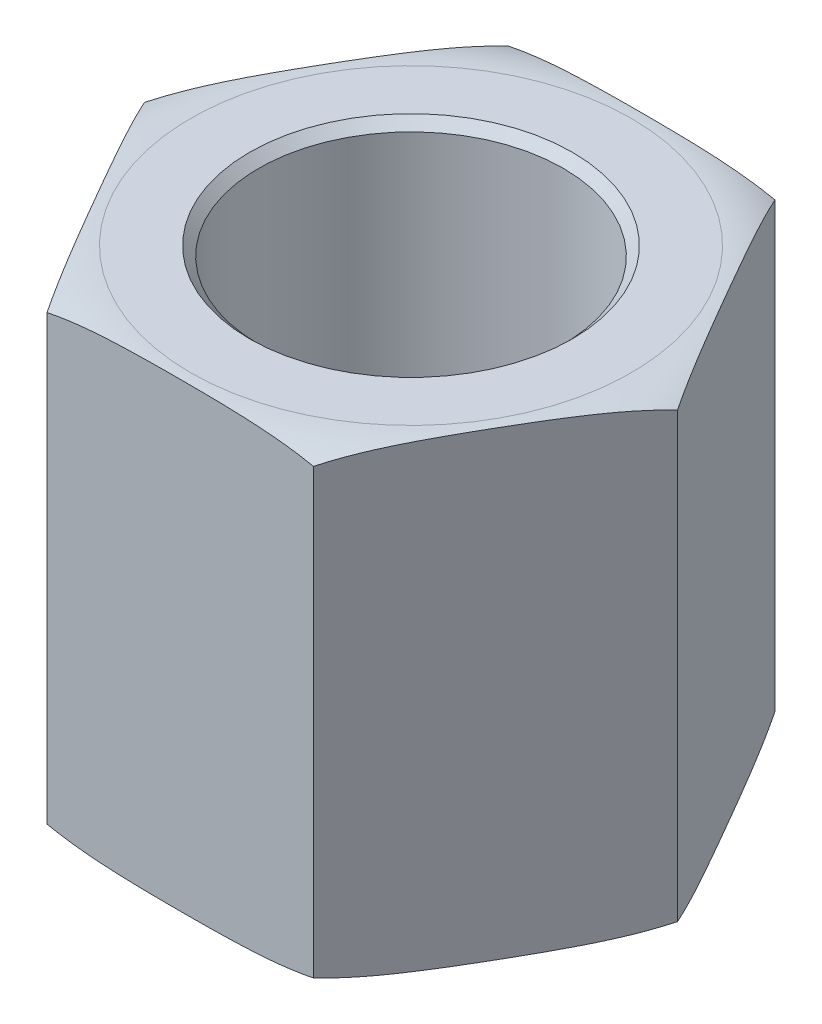
ISO-10303-21;
HEADER;
FILE_DESCRIPTION(('STEP AP214'),'2;1');
FILE_NAME('part.step','',(''),(''),'','','');
FILE_SCHEMA(('AUTOMOTIVE_DESIGN { 1 0 10303 214 1 1 1 1 }'));
ENDSEC;
DATA;
#1=APPLICATION_CONTEXT('core data for automotive mechanical design processes');
#2=APPLICATION_PROTOCOL_DEFINITION('international standard','automotive_design',2000,#1);
#3=PRODUCT_CONTEXT('',#1,'mechanical');
#4=PRODUCT('Part','Part','',(#3));
#5=PRODUCT_RELATED_PRODUCT_CATEGORY('part','',(#4));
#6=PRODUCT_DEFINITION_FORMATION('','',#4);
#7=PRODUCT_DEFINITION_CONTEXT('part definition',#1,'design');
#8=PRODUCT_DEFINITION('design','',#6,#7);
#9=PRODUCT_DEFINITION_SHAPE('','',#8);
#10=(LENGTH_UNIT() NAMED_UNIT(*) SI_UNIT(.MILLI.,.METRE.));
#11=(NAMED_UNIT(*) PLANE_ANGLE_UNIT() SI_UNIT($,.RADIAN.));
#12=(NAMED_UNIT(*) SI_UNIT($,.STERADIAN.) SOLID_ANGLE_UNIT());
#13=UNCERTAINTY_MEASURE_WITH_UNIT(LENGTH_MEASURE(1.E-05),#10,'distance_accuracy_value','');
#14=(GEOMETRIC_REPRESENTATION_CONTEXT(3) GLOBAL_UNCERTAINTY_ASSIGNED_CONTEXT((#13)) GLOBAL_UNIT_ASSIGNED_CONTEXT((#10,
#11,#12)) REPRESENTATION_CONTEXT('',''));
#15=CARTESIAN_POINT('',(0.,0.,0.));
#16=DIRECTION('',(0.,0.,1.));
#17=DIRECTION('',(1.,0.,0.));
#18=AXIS2_PLACEMENT_3D('',#15,#16,#17);
#19=CARTESIAN_POINT('',(3.66617420935412,3.175,0.));
#20=DIRECTION('',(-0.866025403784439,0.,0.5));
#21=DIRECTION('',(0.5,0.,0.866025403784439));
#22=AXIS2_PLACEMENT_3D('',#19,#20,#21);
#23=PLANE('',#22);
#24=DIRECTION('',(0.,1.,0.));
#25=VECTOR('',#24,1.);
#26=CARTESIAN_POINT('',(1.83308710467704,3.175,-3.175));
#27=LINE('',#26,#25);
#28=CARTESIAN_POINT('',(1.83308710467704,-3.048,-3.17500000000001));
#29=VERTEX_POINT('',#28);
#30=CARTESIAN_POINT('',(1.83308710467705,3.048,-3.175));
#31=VERTEX_POINT('',#30);
#32=EDGE_CURVE('E141',#29,#31,#27,.T.);
#33=ORIENTED_EDGE('',*,*,#32,.T.);
#34=CARTESIAN_POINT('',(3.66617420935412,3.048,0.));
#35=CARTESIAN_POINT('',(3.62797961467394,3.06390141489968,-0.0661549785605595));
#36=CARTESIAN_POINT('',(3.58956810864156,3.0774886076105,-0.132685658603879));
#37=CARTESIAN_POINT('',(3.5124905179571,3.10081619794021,-0.266187961794368));
#38=CARTESIAN_POINT('',(3.47382473049846,3.11056047713974,-0.333159070187402));
#39=CARTESIAN_POINT('',(3.39641631867872,3.1269966530451,-0.467234372392399));
#40=CARTESIAN_POINT('',(3.35767399633311,3.13369453286691,-0.534338043098205));
#41=CARTESIAN_POINT('',(3.28009834620112,3.1447767572932,-0.668703010557008));
#42=CARTESIAN_POINT('',(3.24126499587769,3.14916045047396,-0.735964346345298));
#43=CARTESIAN_POINT('',(3.16354065964313,3.15624030042628,-0.870586845688133));
#44=CARTESIAN_POINT('',(3.12464965374474,3.15893552375912,-0.937948043861607));
#45=CARTESIAN_POINT('',(3.0468514459459,3.16315319837134,-1.07269849250699));
#46=CARTESIAN_POINT('',(3.00794424351966,3.16467560802717,-1.1400877438896));
#47=CARTESIAN_POINT('',(2.9305151759887,3.16692270588903,-1.27419882283591));
#48=CARTESIAN_POINT('',(2.89199336248931,3.16765524681808,-1.34092056101655));
#49=CARTESIAN_POINT('',(2.8149477834614,3.16857673025741,-1.47436741839145));
#50=CARTESIAN_POINT('',(2.77642401791435,3.1687656658949,-1.54109253761781));
#51=CARTESIAN_POINT('',(2.69935964431008,3.16866599668056,-1.67457194815387));
#52=CARTESIAN_POINT('',(2.66081903631817,3.16837718117656,-1.74132623935046));
#53=CARTESIAN_POINT('',(2.58373908085325,3.167221986219,-1.87483263846085));
#54=CARTESIAN_POINT('',(2.5451997334124,3.16635559703857,-1.94158474631895));
#55=CARTESIAN_POINT('',(2.46812969629766,3.16378619406563,-2.07507396634291));
#56=CARTESIAN_POINT('',(2.4295990062596,3.16208322716165,-2.14181107913951));
#57=CARTESIAN_POINT('',(2.35255651340903,3.1574387229726,-2.27525259109846));
#58=CARTESIAN_POINT('',(2.31404470975437,3.1544972471358,-2.34195699171945));
#59=CARTESIAN_POINT('',(2.25084206239939,3.14821741247488,-2.45142718811113));
#60=CARTESIAN_POINT('',(2.22613849337005,3.14539801104631,-2.49421502479824));
#61=CARTESIAN_POINT('',(2.17676945272223,3.13886967943036,-2.57972471152119));
#62=CARTESIAN_POINT('',(2.15210397034179,3.1351610809139,-2.62244658019731));
#63=CARTESIAN_POINT('',(2.10282753811692,3.12668027114969,-2.7077958644265));
#64=CARTESIAN_POINT('',(2.07821657107525,3.12190846570084,-2.75042330976607));
#65=CARTESIAN_POINT('',(2.02900094683547,3.11109877125159,-2.8356672714756));
#66=CARTESIAN_POINT('',(2.00439646085461,3.10505773130842,-2.87828349128857));
#67=CARTESIAN_POINT('',(1.95527325900931,3.09151383541611,-2.96336737271508));
#68=CARTESIAN_POINT('',(1.93075459617612,3.08401019780296,-3.00583494247581));
#69=CARTESIAN_POINT('',(1.8818215737317,3.06732035070844,-3.09058942351746));
#70=CARTESIAN_POINT('',(1.85740744053269,3.05813149780328,-3.13287594264091));
#71=CARTESIAN_POINT('',(1.83308710467705,3.048,-3.175));
#72=B_SPLINE_CURVE_WITH_KNOTS('',3,(#34,#35,#36,#37,#38,#39,#40,#41,#42,#43,#44,#45,#46,#47,#48,
#49,#50,#51,#52,#53,#54,#55,#56,#57,#58,#59,#60,#61,#62,#63,#64,#65,#66,#67,#68,#69,#70,#71),
.UNSPECIFIED.,.F.,.F.,(4,2,2,2,2,2,2,2,2,2,2,2,2,2,2,2,2,2,4),(0.,0.23397730781795,
0.467717675040711,0.700996973557527,0.934341903229785,1.16781571967244,1.4012978217983,
1.63243665809676,1.86357841666624,2.09482211846302,2.32606971471504,2.55730435147407,
2.78852751694424,2.93698369265096,3.08538458004481,3.2337289233459,3.38244598546617,
3.53124274626086,3.68027493713586),.UNSPECIFIED.);
#73=CARTESIAN_POINT('',(3.66617420935412,3.048,0.));
#74=VERTEX_POINT('',#73);
#75=EDGE_CURVE('E95',#74,#31,#72,.T.);
#76=ORIENTED_EDGE('',*,*,#75,.F.);
#77=DIRECTION('',(0.,1.,0.));
#78=VECTOR('',#77,1.);
#79=CARTESIAN_POINT('',(3.66617420935412,3.175,0.));
#80=LINE('',#79,#78);
#81=CARTESIAN_POINT('',(3.66617420935412,-3.048,0.));
#82=VERTEX_POINT('',#81);
#83=EDGE_CURVE('E143',#74,#82,#80,.F.);
#84=ORIENTED_EDGE('',*,*,#83,.T.);
#85=CARTESIAN_POINT('',(1.83308710467705,-3.048,-3.17500000000001));
#86=CARTESIAN_POINT('',(1.87128169935723,-3.06390141489968,-3.10884502143945));
#87=CARTESIAN_POINT('',(1.9096932053896,-3.0774886076105,-3.04231434139613));
#88=CARTESIAN_POINT('',(1.98677079607407,-3.1008161979402,-2.90881203820564));
#89=CARTESIAN_POINT('',(2.02543658353271,-3.11056047713974,-2.84184092981261));
#90=CARTESIAN_POINT('',(2.10284499535245,-3.12699665304509,-2.70776562760762));
#91=CARTESIAN_POINT('',(2.14158731769805,-3.13369453286691,-2.64066195690181));
#92=CARTESIAN_POINT('',(2.21916296783005,-3.14477675729319,-2.50629698944301));
#93=CARTESIAN_POINT('',(2.25799631815347,-3.14916045047396,-2.43903565365472));
#94=CARTESIAN_POINT('',(2.33572065438803,-3.15624030042628,-2.30441315431189));
#95=CARTESIAN_POINT('',(2.37461166028642,-3.15893552375912,-2.23705195613842));
#96=CARTESIAN_POINT('',(2.45240986808526,-3.16315319837134,-2.10230150749304));
#97=CARTESIAN_POINT('',(2.49131707051149,-3.16467560802717,-2.03491225611043));
#98=CARTESIAN_POINT('',(2.56874613804246,-3.16692270588903,-1.90080117716412));
#99=CARTESIAN_POINT('',(2.60726795154184,-3.16765524681808,-1.83407943898349));
#100=CARTESIAN_POINT('',(2.68431353056976,-3.16857673025742,-1.70063258160858));
#101=CARTESIAN_POINT('',(2.7228372961168,-3.1687656658949,-1.63390746238223));
#102=CARTESIAN_POINT('',(2.79990166972107,-3.16866599668056,-1.50042805184616));
#103=CARTESIAN_POINT('',(2.83844227771298,-3.16837718117656,-1.43367376064958));
#104=CARTESIAN_POINT('',(2.9155222331779,-3.167221986219,-1.30016736153919));
#105=CARTESIAN_POINT('',(2.95406158061874,-3.16635559703857,-1.2334152536811));
#106=CARTESIAN_POINT('',(3.03113161773349,-3.16378619406563,-1.09992603365714));
#107=CARTESIAN_POINT('',(3.06966230777155,-3.16208322716165,-1.03318892086054));
#108=CARTESIAN_POINT('',(3.14670480062212,-3.15743872297261,-0.89974740890159));
#109=CARTESIAN_POINT('',(3.18521660427678,-3.1544972471358,-0.833043008280603));
#110=CARTESIAN_POINT('',(3.24841925163175,-3.14821741247488,-0.723572811888921));
#111=CARTESIAN_POINT('',(3.2731228206611,-3.14539801104632,-0.680784975201808));
#112=CARTESIAN_POINT('',(3.32249186130892,-3.13886967943036,-0.595275288478853));
#113=CARTESIAN_POINT('',(3.34715734368936,-3.1351610809139,-0.552553419802732));
#114=CARTESIAN_POINT('',(3.39643377591423,-3.12668027114969,-0.467204135573528));
#115=CARTESIAN_POINT('',(3.4210447429559,-3.12190846570084,-0.424576690233956));
#116=CARTESIAN_POINT('',(3.47026036719569,-3.11109877125159,-0.339332728524421));
#117=CARTESIAN_POINT('',(3.49486485317655,-3.10505773130842,-0.296716508711452));
#118=CARTESIAN_POINT('',(3.54398805502185,-3.09151383541612,-0.211632627284937));
#119=CARTESIAN_POINT('',(3.56850671785504,-3.08401019780296,-0.169165057524198));
#120=CARTESIAN_POINT('',(3.61743974029947,-3.06732035070844,-0.0844105764825437));
#121=CARTESIAN_POINT('',(3.64185387349848,-3.05813149780329,-0.0421240573590973));
#122=CARTESIAN_POINT('',(3.66617420935412,-3.048,0.));
#123=B_SPLINE_CURVE_WITH_KNOTS('',3,(#85,#86,#87,#88,#89,#90,#91,#92,#93,#94,#95,#96,#97,#98,
#99,#100,#101,#102,#103,#104,#105,#106,#107,#108,#109,#110,#111,#112,#113,#114,#115,#116,#117,
#118,#119,#120,#121,#122),.UNSPECIFIED.,.F.,.F.,(4,2,2,2,2,2,2,2,2,2,2,2,2,2,2,2,2,2,4),(0.,
0.233977307817946,0.467717675040702,0.700996973557513,0.934341903229767,1.16781571967242,
1.40129782179827,1.63243665809673,1.8635784166662,2.09482211846298,2.32606971471499,
2.55730435147402,2.78852751694418,2.93698369265092,3.08538458004477,3.23372892334588,
3.38244598546615,3.53124274626086,3.68027493713586),.UNSPECIFIED.);
#124=EDGE_CURVE('E219',#29,#82,#123,.T.);
#125=ORIENTED_EDGE('',*,*,#124,.F.);
#126=EDGE_LOOP('',(#33,#76,#84,#125));
#127=FACE_BOUND('',#126,.T.);
#128=ADVANCED_FACE('F15',(#127),#23,.F.);
#129=CARTESIAN_POINT('',(1.83308710467706,3.175,3.17499999999999));
#130=DIRECTION('',(-0.866025403784439,0.,-0.5));
#131=DIRECTION('',(-0.5,0.,0.866025403784439));
#132=AXIS2_PLACEMENT_3D('',#129,#130,#131);
#133=PLANE('',#132);
#134=ORIENTED_EDGE('',*,*,#83,.F.);
#135=CARTESIAN_POINT('',(1.83308710467706,3.048,3.17499999999999));
#136=CARTESIAN_POINT('',(1.87128169935724,3.06390141489968,3.10884502143943));
#137=CARTESIAN_POINT('',(1.90969320538962,3.0774886076105,3.04231434139611));
#138=CARTESIAN_POINT('',(1.98677079607408,3.10081619794021,2.90881203820562));
#139=CARTESIAN_POINT('',(2.02543658353273,3.11056047713974,2.84184092981259));
#140=CARTESIAN_POINT('',(2.10284499535246,3.1269966530451,2.70776562760759));
#141=CARTESIAN_POINT('',(2.14158731769807,3.13369453286691,2.64066195690179));
#142=CARTESIAN_POINT('',(2.21916296783006,3.1447767572932,2.50629698944298));
#143=CARTESIAN_POINT('',(2.25799631815349,3.14916045047396,2.43903565365469));
#144=CARTESIAN_POINT('',(2.33572065438805,3.15624030042628,2.30441315431186));
#145=CARTESIAN_POINT('',(2.37461166028644,3.15893552375912,2.23705195613839));
#146=CARTESIAN_POINT('',(2.45240986808528,3.16315319837134,2.102301507493));
#147=CARTESIAN_POINT('',(2.49131707051152,3.16467560802717,2.03491225611039));
#148=CARTESIAN_POINT('',(2.56874613804248,3.16692270588903,1.90080117716408));
#149=CARTESIAN_POINT('',(2.60726795154187,3.16765524681808,1.83407943898345));
#150=CARTESIAN_POINT('',(2.68431353056978,3.16857673025741,1.70063258160854));
#151=CARTESIAN_POINT('',(2.72283729611683,3.1687656658949,1.63390746238219));
#152=CARTESIAN_POINT('',(2.7999016697211,3.16866599668056,1.50042805184612));
#153=CARTESIAN_POINT('',(2.83844227771301,3.16837718117656,1.43367376064953));
#154=CARTESIAN_POINT('',(2.91552223317793,3.167221986219,1.30016736153914));
#155=CARTESIAN_POINT('',(2.95406158061878,3.16635559703857,1.23341525368105));
#156=CARTESIAN_POINT('',(3.03113161773353,3.16378619406563,1.09992603365708));
#157=CARTESIAN_POINT('',(3.06966230777158,3.16208322716165,1.03318892086048));
#158=CARTESIAN_POINT('',(3.14670480062215,3.1574387229726,0.899747408901533));
#159=CARTESIAN_POINT('',(3.18521660427681,3.1544972471358,0.833043008280545));
#160=CARTESIAN_POINT('',(3.24841925163179,3.14821741247488,0.723572811888865));
#161=CARTESIAN_POINT('',(3.27312282066113,3.14539801104631,0.680784975201756));
#162=CARTESIAN_POINT('',(3.32249186130895,3.13886967943036,0.595275288478808));
#163=CARTESIAN_POINT('',(3.34715734368939,3.1351610809139,0.55255341980269));
#164=CARTESIAN_POINT('',(3.39643377591426,3.12668027114969,0.467204135573494));
#165=CARTESIAN_POINT('',(3.42104474295592,3.12190846570084,0.424576690233925));
#166=CARTESIAN_POINT('',(3.47026036719571,3.11109877125159,0.339332728524397));
#167=CARTESIAN_POINT('',(3.49486485317657,3.10505773130842,0.296716508711432));
#168=CARTESIAN_POINT('',(3.54398805502186,3.09151383541612,0.211632627284924));
#169=CARTESIAN_POINT('',(3.56850671785505,3.08401019780296,0.169165057524189));
#170=CARTESIAN_POINT('',(3.61743974029947,3.06732035070844,0.0844105764825421));
#171=CARTESIAN_POINT('',(3.64185387349848,3.05813149780328,0.0421240573590994));
#172=CARTESIAN_POINT('',(3.66617420935412,3.048,0.));
#173=B_SPLINE_CURVE_WITH_KNOTS('',3,(#135,#136,#137,#138,#139,#140,#141,#142,#143,#144,#145,
#146,#147,#148,#149,#150,#151,#152,#153,#154,#155,#156,#157,#158,#159,#160,#161,#162,#163,#164,
#165,#166,#167,#168,#169,#170,#171,#172),.UNSPECIFIED.,.F.,.F.,(4,2,2,2,2,2,2,2,2,2,2,2,2,2,2,2,
2,2,4),(0.,0.23397730781795,0.467717675040712,0.700996973557526,0.934341903229785,
1.16781571967244,1.4012978217983,1.63243665809676,1.86357841666624,2.09482211846302,
2.32606971471504,2.55730435147407,2.78852751694424,2.93698369265096,3.0853845800448,
3.23372892334589,3.38244598546615,3.53124274626085,3.68027493713584),.UNSPECIFIED.);
#174=CARTESIAN_POINT('',(1.83308710467706,3.048,3.17499999999999));
#175=VERTEX_POINT('',#174);
#176=EDGE_CURVE('E212',#175,#74,#173,.T.);
#177=ORIENTED_EDGE('',*,*,#176,.F.);
#178=DIRECTION('',(0.,1.,0.));
#179=VECTOR('',#178,1.);
#180=CARTESIAN_POINT('',(1.83308710467706,3.175,3.17499999999999));
#181=LINE('',#180,#179);
#182=CARTESIAN_POINT('',(1.83308710467706,-3.048,3.17499999999999));
#183=VERTEX_POINT('',#182);
#184=EDGE_CURVE('E138',#175,#183,#181,.F.);
#185=ORIENTED_EDGE('',*,*,#184,.T.);
#186=CARTESIAN_POINT('',(3.66617420935412,-3.048,0.));
#187=CARTESIAN_POINT('',(3.62797961467394,-3.06390141489968,0.0661549785605642));
#188=CARTESIAN_POINT('',(3.58956810864156,-3.0774886076105,0.132685658603884));
#189=CARTESIAN_POINT('',(3.5124905179571,-3.10081619794021,0.266187961794373));
#190=CARTESIAN_POINT('',(3.47382473049845,-3.11056047713974,0.333159070187407));
#191=CARTESIAN_POINT('',(3.39641631867872,-3.1269966530451,0.467234372392404));
#192=CARTESIAN_POINT('',(3.35767399633311,-3.13369453286691,0.53433804309821));
#193=CARTESIAN_POINT('',(3.28009834620112,-3.1447767572932,0.668703010557013));
#194=CARTESIAN_POINT('',(3.24126499587769,-3.14916045047396,0.735964346345303));
#195=CARTESIAN_POINT('',(3.16354065964313,-3.15624030042628,0.870586845688138));
#196=CARTESIAN_POINT('',(3.12464965374474,-3.15893552375912,0.937948043861613));
#197=CARTESIAN_POINT('',(3.0468514459459,-3.16315319837134,1.07269849250699));
#198=CARTESIAN_POINT('',(3.00794424351966,-3.16467560802717,1.1400877438896));
#199=CARTESIAN_POINT('',(2.9305151759887,-3.16692270588903,1.27419882283592));
#200=CARTESIAN_POINT('',(2.89199336248931,-3.16765524681808,1.34092056101655));
#201=CARTESIAN_POINT('',(2.8149477834614,-3.16857673025741,1.47436741839146));
#202=CARTESIAN_POINT('',(2.77642401791435,-3.1687656658949,1.54109253761781));
#203=CARTESIAN_POINT('',(2.69935964431008,-3.16866599668056,1.67457194815388));
#204=CARTESIAN_POINT('',(2.66081903631817,-3.16837718117656,1.74132623935047));
#205=CARTESIAN_POINT('',(2.58373908085325,-3.167221986219,1.87483263846085));
#206=CARTESIAN_POINT('',(2.5451997334124,-3.16635559703857,1.94158474631895));
#207=CARTESIAN_POINT('',(2.46812969629765,-3.16378619406563,2.07507396634292));
#208=CARTESIAN_POINT('',(2.4295990062596,-3.16208322716165,2.14181107913952));
#209=CARTESIAN_POINT('',(2.35255651340903,-3.1574387229726,2.27525259109847));
#210=CARTESIAN_POINT('',(2.31404470975437,-3.1544972471358,2.34195699171945));
#211=CARTESIAN_POINT('',(2.25084206239939,-3.14821741247488,2.45142718811113));
#212=CARTESIAN_POINT('',(2.22613849337005,-3.14539801104631,2.49421502479824));
#213=CARTESIAN_POINT('',(2.17676945272223,-3.13886967943036,2.57972471152119));
#214=CARTESIAN_POINT('',(2.15210397034179,-3.1351610809139,2.62244658019731));
#215=CARTESIAN_POINT('',(2.10282753811692,-3.12668027114969,2.7077958644265));
#216=CARTESIAN_POINT('',(2.07821657107526,-3.12190846570084,2.75042330976607));
#217=CARTESIAN_POINT('',(2.02900094683547,-3.11109877125159,2.8356672714756));
#218=CARTESIAN_POINT('',(2.00439646085461,-3.10505773130842,2.87828349128856));
#219=CARTESIAN_POINT('',(1.95527325900932,-3.09151383541611,2.96336737271507));
#220=CARTESIAN_POINT('',(1.93075459617613,-3.08401019780296,3.00583494247581));
#221=CARTESIAN_POINT('',(1.88182157373171,-3.06732035070844,3.09058942351745));
#222=CARTESIAN_POINT('',(1.8574074405327,-3.05813149780328,3.1328759426409));
#223=CARTESIAN_POINT('',(1.83308710467706,-3.048,3.17499999999999));
#224=B_SPLINE_CURVE_WITH_KNOTS('',3,(#186,#187,#188,#189,#190,#191,#192,#193,#194,#195,#196,
#197,#198,#199,#200,#201,#202,#203,#204,#205,#206,#207,#208,#209,#210,#211,#212,#213,#214,#215,
#216,#217,#218,#219,#220,#221,#222,#223),.UNSPECIFIED.,.F.,.F.,(4,2,2,2,2,2,2,2,2,2,2,2,2,2,2,2,
2,2,4),(0.,0.23397730781795,0.467717675040712,0.700996973557527,0.934341903229786,
1.16781571967244,1.4012978217983,1.63243665809676,1.86357841666624,2.09482211846302,
2.32606971471504,2.55730435147408,2.78852751694424,2.93698369265096,3.0853845800448,
3.23372892334589,3.38244598546615,3.53124274626085,3.68027493713584),.UNSPECIFIED.);
#225=EDGE_CURVE('E238',#82,#183,#224,.T.);
#226=ORIENTED_EDGE('',*,*,#225,.F.);
#227=EDGE_LOOP('',(#134,#177,#185,#226));
#228=FACE_BOUND('',#227,.T.);
#229=ADVANCED_FACE('F216',(#228),#133,.F.);
#230=CARTESIAN_POINT('',(1.83308710467706,3.175,-3.175));
#231=DIRECTION('',(0.,0.,1.));
#232=DIRECTION('',(1.,0.,0.));
#233=AXIS2_PLACEMENT_3D('',#230,#231,#232);
#234=PLANE('',#233);
#235=DIRECTION('',(0.,1.,0.));
#236=VECTOR('',#235,1.);
#237=CARTESIAN_POINT('',(-1.83308710467707,3.175,-3.175));
#238=LINE('',#237,#236);
#239=CARTESIAN_POINT('',(-1.83308710467707,-3.048,-3.175));
#240=VERTEX_POINT('',#239);
#241=CARTESIAN_POINT('',(-1.83308710467706,3.048,-3.17500000000001));
#242=VERTEX_POINT('',#241);
#243=EDGE_CURVE('E102',#240,#242,#238,.T.);
#244=ORIENTED_EDGE('',*,*,#243,.T.);
#245=CARTESIAN_POINT('',(1.83308710467706,3.048,-3.17500000000001));
#246=CARTESIAN_POINT('',(1.73237579828683,3.06894001415179,-3.175));
#247=CARTESIAN_POINT('',(1.63096506893486,3.08588534953273,-3.175));
#248=CARTESIAN_POINT('',(1.42767146651469,3.11349716439842,-3.175));
#249=CARTESIAN_POINT('',(1.32579191427254,3.12418756587531,-3.175));
#250=CARTESIAN_POINT('',(1.12177634709137,3.14112804080793,-3.175));
#251=CARTESIAN_POINT('',(1.01964056643379,3.14738127071887,-3.175));
#252=CARTESIAN_POINT('',(0.815663681397375,3.15690280641833,-3.175));
#253=CARTESIAN_POINT('',(0.713823115514572,3.1601834044999,-3.175));
#254=CARTESIAN_POINT('',(0.510018485441651,3.16494548487028,-3.175));
#255=CARTESIAN_POINT('',(0.408054390577976,3.16642541008817,-3.175));
#256=CARTESIAN_POINT('',(0.20406020033787,3.16831468183792,-3.175));
#257=CARTESIAN_POINT('',(0.102030100168935,3.16872342414921,-3.175));
#258=CARTESIAN_POINT('',(-0.102030100168934,3.16872342414921,-3.175));
#259=CARTESIAN_POINT('',(-0.204060200337869,3.16831468183792,-3.175));
#260=CARTESIAN_POINT('',(-0.408054390577974,3.16642541008817,-3.175));
#261=CARTESIAN_POINT('',(-0.510018485441649,3.16494548487028,-3.175));
#262=CARTESIAN_POINT('',(-0.71382311551457,3.1601834044999,-3.175));
#263=CARTESIAN_POINT('',(-0.815663681397372,3.15690280641833,-3.175));
#264=CARTESIAN_POINT('',(-1.01964056643379,3.14738127071887,-3.175));
#265=CARTESIAN_POINT('',(-1.12177634709137,3.14112804080793,-3.175));
#266=CARTESIAN_POINT('',(-1.32579191427253,3.12418756587531,-3.175));
#267=CARTESIAN_POINT('',(-1.42767146651468,3.11349716439842,-3.175));
#268=CARTESIAN_POINT('',(-1.63096506893485,3.08588534953273,-3.175));
#269=CARTESIAN_POINT('',(-1.73237579828682,3.06894001415179,-3.175));
#270=CARTESIAN_POINT('',(-1.83308710467705,3.048,-3.175));
#271=B_SPLINE_CURVE_WITH_KNOTS('',3,(#245,#246,#247,#248,#249,#250,#251,#252,#253,#254,#255,
#256,#257,#258,#259,#260,#261,#262,#263,#264,#265,#266,#267,#268,#269,#270),.UNSPECIFIED.,.F.,
.F.,(4,2,2,2,2,2,2,2,2,2,2,2,4),(0.,0.308333242342807,0.615479423308234,0.922406891130007,
1.2280592962085,1.53397581645216,1.84006485747888,2.14615389850561,2.45207041874927,
2.75772282382776,3.06465029164953,3.37179647261496,3.68012971495776),.UNSPECIFIED.);
#272=EDGE_CURVE('E87',#31,#242,#271,.T.);
#273=ORIENTED_EDGE('',*,*,#272,.F.);
#274=ORIENTED_EDGE('',*,*,#32,.F.);
#275=CARTESIAN_POINT('',(-1.83308710467707,-3.048,-3.175));
#276=CARTESIAN_POINT('',(-1.73237579828684,-3.06894001415179,-3.175));
#277=CARTESIAN_POINT('',(-1.63096506893487,-3.08588534953273,-3.175));
#278=CARTESIAN_POINT('',(-1.4276714665147,-3.11349716439842,-3.175));
#279=CARTESIAN_POINT('',(-1.32579191427255,-3.12418756587531,-3.175));
#280=CARTESIAN_POINT('',(-1.12177634709138,-3.14112804080793,-3.175));
#281=CARTESIAN_POINT('',(-1.0196405664338,-3.14738127071887,-3.175));
#282=CARTESIAN_POINT('',(-0.81566368139738,-3.15690280641833,-3.175));
#283=CARTESIAN_POINT('',(-0.713823115514576,-3.1601834044999,-3.175));
#284=CARTESIAN_POINT('',(-0.510018485441653,-3.16494548487028,-3.175));
#285=CARTESIAN_POINT('',(-0.408054390577979,-3.16642541008817,-3.175));
#286=CARTESIAN_POINT('',(-0.204060200337872,-3.16831468183792,-3.175));
#287=CARTESIAN_POINT('',(-0.102030100168936,-3.16872342414921,-3.175));
#288=CARTESIAN_POINT('',(0.102030100168934,-3.16872342414921,-3.175));
#289=CARTESIAN_POINT('',(0.204060200337869,-3.16831468183792,-3.175));
#290=CARTESIAN_POINT('',(0.408054390577973,-3.16642541008817,-3.175));
#291=CARTESIAN_POINT('',(0.510018485441647,-3.16494548487028,-3.175));
#292=CARTESIAN_POINT('',(0.713823115514568,-3.1601834044999,-3.175));
#293=CARTESIAN_POINT('',(0.81566368139737,-3.15690280641833,-3.175));
#294=CARTESIAN_POINT('',(1.01964056643379,-3.14738127071887,-3.175));
#295=CARTESIAN_POINT('',(1.12177634709137,-3.14112804080793,-3.175));
#296=CARTESIAN_POINT('',(1.32579191427253,-3.12418756587531,-3.175));
#297=CARTESIAN_POINT('',(1.42767146651468,-3.11349716439842,-3.175));
#298=CARTESIAN_POINT('',(1.63096506893485,-3.08588534953273,-3.175));
#299=CARTESIAN_POINT('',(1.73237579828682,-3.06894001415179,-3.175));
#300=CARTESIAN_POINT('',(1.83308710467704,-3.048,-3.17500000000001));
#301=B_SPLINE_CURVE_WITH_KNOTS('',3,(#275,#276,#277,#278,#279,#280,#281,#282,#283,#284,#285,
#286,#287,#288,#289,#290,#291,#292,#293,#294,#295,#296,#297,#298,#299,#300),.UNSPECIFIED.,.F.,
.F.,(4,2,2,2,2,2,2,2,2,2,2,2,4),(0.,0.308333242342809,0.615479423308238,0.922406891130013,
1.22805929620851,1.53397581645217,1.8400648574789,2.14615389850562,2.45207041874928,
2.75772282382777,3.06465029164954,3.37179647261496,3.68012971495777),.UNSPECIFIED.);
#302=EDGE_CURVE('E104',#240,#29,#301,.T.);
#303=ORIENTED_EDGE('',*,*,#302,.F.);
#304=EDGE_LOOP('',(#244,#273,#274,#303));
#305=FACE_BOUND('',#304,.T.);
#306=ADVANCED_FACE('F103',(#305),#234,.F.);
#307=CARTESIAN_POINT('',(-1.83308710467707,3.175,3.175));
#308=DIRECTION('',(0.,0.,-1.));
#309=DIRECTION('',(-1.,0.,0.));
#310=AXIS2_PLACEMENT_3D('',#307,#308,#309);
#311=PLANE('',#310);
#312=ORIENTED_EDGE('',*,*,#184,.F.);
#313=CARTESIAN_POINT('',(-1.83308710467706,3.048,3.175));
#314=CARTESIAN_POINT('',(-1.73237579828684,3.06894001415179,3.175));
#315=CARTESIAN_POINT('',(-1.63096506893486,3.08588534953273,3.175));
#316=CARTESIAN_POINT('',(-1.42767146651469,3.11349716439842,3.175));
#317=CARTESIAN_POINT('',(-1.32579191427254,3.12418756587531,3.175));
#318=CARTESIAN_POINT('',(-1.12177634709138,3.14112804080793,3.175));
#319=CARTESIAN_POINT('',(-1.0196405664338,3.14738127071887,3.175));
#320=CARTESIAN_POINT('',(-0.815663681397378,3.15690280641833,3.175));
#321=CARTESIAN_POINT('',(-0.713823115514575,3.1601834044999,3.175));
#322=CARTESIAN_POINT('',(-0.510018485441652,3.16494548487028,3.175));
#323=CARTESIAN_POINT('',(-0.408054390577977,3.16642541008817,3.175));
#324=CARTESIAN_POINT('',(-0.204060200337871,3.16831468183792,3.175));
#325=CARTESIAN_POINT('',(-0.102030100168935,3.16872342414921,3.175));
#326=CARTESIAN_POINT('',(0.102030100168935,3.16872342414921,3.175));
#327=CARTESIAN_POINT('',(0.204060200337871,3.16831468183792,3.17499999999999));
#328=CARTESIAN_POINT('',(0.408054390577978,3.16642541008817,3.17499999999999));
#329=CARTESIAN_POINT('',(0.510018485441653,3.16494548487028,3.17499999999999));
#330=CARTESIAN_POINT('',(0.713823115514575,3.1601834044999,3.17499999999999));
#331=CARTESIAN_POINT('',(0.815663681397378,3.15690280641833,3.17499999999999));
#332=CARTESIAN_POINT('',(1.0196405664338,3.14738127071887,3.17499999999999));
#333=CARTESIAN_POINT('',(1.12177634709138,3.14112804080793,3.17499999999999));
#334=CARTESIAN_POINT('',(1.32579191427254,3.12418756587531,3.17499999999999));
#335=CARTESIAN_POINT('',(1.4276714665147,3.11349716439842,3.17499999999999));
#336=CARTESIAN_POINT('',(1.63096506893486,3.08588534953273,3.17499999999999));
#337=CARTESIAN_POINT('',(1.73237579828684,3.06894001415179,3.17499999999999));
#338=CARTESIAN_POINT('',(1.83308710467706,3.048,3.17499999999999));
#339=B_SPLINE_CURVE_WITH_KNOTS('',3,(#313,#314,#315,#316,#317,#318,#319,#320,#321,#322,#323,
#324,#325,#326,#327,#328,#329,#330,#331,#332,#333,#334,#335,#336,#337,#338),.UNSPECIFIED.,.F.,
.F.,(4,2,2,2,2,2,2,2,2,2,2,2,4),(0.,0.308333242342808,0.615479423308236,0.922406891130011,
1.2280592962085,1.53397581645216,1.84006485747889,2.14615389850562,2.45207041874928,
2.75772282382777,3.06465029164955,3.37179647261498,3.68012971495778),.UNSPECIFIED.);
#340=CARTESIAN_POINT('',(-1.83308710467707,3.048,3.175));
#341=VERTEX_POINT('',#340);
#342=EDGE_CURVE('E98',#341,#175,#339,.T.);
#343=ORIENTED_EDGE('',*,*,#342,.F.);
#344=DIRECTION('',(0.,1.,0.));
#345=VECTOR('',#344,1.);
#346=CARTESIAN_POINT('',(-1.83308710467707,3.175,3.175));
#347=LINE('',#346,#345);
#348=CARTESIAN_POINT('',(-1.83308710467706,-3.048,3.175));
#349=VERTEX_POINT('',#348);
#350=EDGE_CURVE('E106',#341,#349,#347,.F.);
#351=ORIENTED_EDGE('',*,*,#350,.T.);
#352=CARTESIAN_POINT('',(1.83308710467706,-3.048,3.17499999999999));
#353=CARTESIAN_POINT('',(1.73237579828684,-3.06894001415179,3.17499999999999));
#354=CARTESIAN_POINT('',(1.63096506893486,-3.08588534953273,3.17499999999999));
#355=CARTESIAN_POINT('',(1.4276714665147,-3.11349716439842,3.17499999999999));
#356=CARTESIAN_POINT('',(1.32579191427254,-3.12418756587531,3.17499999999999));
#357=CARTESIAN_POINT('',(1.12177634709138,-3.14112804080793,3.17499999999999));
#358=CARTESIAN_POINT('',(1.0196405664338,-3.14738127071887,3.17499999999999));
#359=CARTESIAN_POINT('',(0.815663681397379,-3.15690280641833,3.17499999999999));
#360=CARTESIAN_POINT('',(0.713823115514576,-3.1601834044999,3.17499999999999));
#361=CARTESIAN_POINT('',(0.510018485441653,-3.16494548487028,3.17499999999999));
#362=CARTESIAN_POINT('',(0.408054390577978,-3.16642541008817,3.17499999999999));
#363=CARTESIAN_POINT('',(0.204060200337871,-3.16831468183792,3.17499999999999));
#364=CARTESIAN_POINT('',(0.102030100168935,-3.16872342414921,3.175));
#365=CARTESIAN_POINT('',(-0.102030100168935,-3.16872342414921,3.175));
#366=CARTESIAN_POINT('',(-0.204060200337871,-3.16831468183792,3.175));
#367=CARTESIAN_POINT('',(-0.408054390577977,-3.16642541008817,3.175));
#368=CARTESIAN_POINT('',(-0.510018485441652,-3.16494548487028,3.175));
#369=CARTESIAN_POINT('',(-0.713823115514574,-3.1601834044999,3.175));
#370=CARTESIAN_POINT('',(-0.815663681397377,-3.15690280641833,3.175));
#371=CARTESIAN_POINT('',(-1.0196405664338,-3.14738127071887,3.175));
#372=CARTESIAN_POINT('',(-1.12177634709138,-3.14112804080793,3.175));
#373=CARTESIAN_POINT('',(-1.32579191427254,-3.12418756587531,3.175));
#374=CARTESIAN_POINT('',(-1.42767146651469,-3.11349716439842,3.175));
#375=CARTESIAN_POINT('',(-1.63096506893486,-3.08588534953273,3.175));
#376=CARTESIAN_POINT('',(-1.73237579828683,-3.06894001415179,3.175));
#377=CARTESIAN_POINT('',(-1.83308710467706,-3.048,3.175));
#378=B_SPLINE_CURVE_WITH_KNOTS('',3,(#352,#353,#354,#355,#356,#357,#358,#359,#360,#361,#362,
#363,#364,#365,#366,#367,#368,#369,#370,#371,#372,#373,#374,#375,#376,#377),.UNSPECIFIED.,.F.,
.F.,(4,2,2,2,2,2,2,2,2,2,2,2,4),(0.,0.308333242342808,0.615479423308237,0.922406891130012,
1.22805929620851,1.53397581645217,1.84006485747889,2.14615389850562,2.45207041874928,
2.75772282382777,3.06465029164955,3.37179647261498,3.68012971495778),.UNSPECIFIED.);
#379=EDGE_CURVE('E206',#183,#349,#378,.T.);
#380=ORIENTED_EDGE('',*,*,#379,.F.);
#381=EDGE_LOOP('',(#312,#343,#351,#380));
#382=FACE_BOUND('',#381,.T.);
#383=ADVANCED_FACE('F350',(#382),#311,.F.);
#384=CARTESIAN_POINT('',(-3.66617420935413,3.175,0.));
#385=DIRECTION('',(0.866025403784439,0.,-0.499999999999999));
#386=DIRECTION('',(-0.499999999999999,0.,-0.866025403784439));
#387=AXIS2_PLACEMENT_3D('',#384,#385,#386);
#388=PLANE('',#387);
#389=ORIENTED_EDGE('',*,*,#350,.F.);
#390=CARTESIAN_POINT('',(-3.66617420935412,3.048,0.));
#391=CARTESIAN_POINT('',(-3.62797961467395,3.06390141489968,0.0661549785605639));
#392=CARTESIAN_POINT('',(-3.58956810864157,3.0774886076105,0.132685658603883));
#393=CARTESIAN_POINT('',(-3.51249051795711,3.10081619794021,0.266187961794372));
#394=CARTESIAN_POINT('',(-3.47382473049846,3.11056047713974,0.333159070187406));
#395=CARTESIAN_POINT('',(-3.39641631867873,3.12699665304509,0.467234372392402));
#396=CARTESIAN_POINT('',(-3.35767399633312,3.13369453286691,0.534338043098208));
#397=CARTESIAN_POINT('',(-3.28009834620112,3.14477675729319,0.66870301055701));
#398=CARTESIAN_POINT('',(-3.2412649958777,3.14916045047396,0.7359643463453));
#399=CARTESIAN_POINT('',(-3.16354065964313,3.15624030042628,0.870586845688136));
#400=CARTESIAN_POINT('',(-3.12464965374474,3.15893552375912,0.937948043861609));
#401=CARTESIAN_POINT('',(-3.04685144594591,3.16315319837134,1.07269849250699));
#402=CARTESIAN_POINT('',(-3.00794424351967,3.16467560802717,1.1400877438896));
#403=CARTESIAN_POINT('',(-2.93051517598871,3.16692270588903,1.27419882283591));
#404=CARTESIAN_POINT('',(-2.89199336248932,3.16765524681808,1.34092056101655));
#405=CARTESIAN_POINT('',(-2.81494778346141,3.16857673025741,1.47436741839145));
#406=CARTESIAN_POINT('',(-2.77642401791436,3.1687656658949,1.54109253761781));
#407=CARTESIAN_POINT('',(-2.69935964431009,3.16866599668056,1.67457194815387));
#408=CARTESIAN_POINT('',(-2.66081903631818,3.16837718117655,1.74132623935046));
#409=CARTESIAN_POINT('',(-2.58373908085326,3.16722198621899,1.87483263846085));
#410=CARTESIAN_POINT('',(-2.54519973341241,3.16635559703857,1.94158474631894));
#411=CARTESIAN_POINT('',(-2.46812969629766,3.16378619406563,2.07507396634291));
#412=CARTESIAN_POINT('',(-2.42959900625961,3.16208322716165,2.14181107913951));
#413=CARTESIAN_POINT('',(-2.35255651340904,3.1574387229726,2.27525259109846));
#414=CARTESIAN_POINT('',(-2.31404470975438,3.1544972471358,2.34195699171945));
#415=CARTESIAN_POINT('',(-2.2508420623994,3.14821741247488,2.45142718811113));
#416=CARTESIAN_POINT('',(-2.22613849337006,3.14539801104631,2.49421502479824));
#417=CARTESIAN_POINT('',(-2.17676945272224,3.13886967943036,2.57972471152119));
#418=CARTESIAN_POINT('',(-2.1521039703418,3.1351610809139,2.62244658019731));
#419=CARTESIAN_POINT('',(-2.10282753811693,3.12668027114968,2.7077958644265));
#420=CARTESIAN_POINT('',(-2.07821657107527,3.12190846570084,2.75042330976607));
#421=CARTESIAN_POINT('',(-2.02900094683548,3.11109877125159,2.8356672714756));
#422=CARTESIAN_POINT('',(-2.00439646085462,3.10505773130841,2.87828349128857));
#423=CARTESIAN_POINT('',(-1.95527325900933,3.09151383541611,2.96336737271508));
#424=CARTESIAN_POINT('',(-1.93075459617614,3.08401019780296,3.00583494247581));
#425=CARTESIAN_POINT('',(-1.88182157373171,3.06732035070844,3.09058942351746));
#426=CARTESIAN_POINT('',(-1.8574074405327,3.05813149780328,3.1328759426409));
#427=CARTESIAN_POINT('',(-1.83308710467707,3.048,3.175));
#428=B_SPLINE_CURVE_WITH_KNOTS('',3,(#390,#391,#392,#393,#394,#395,#396,#397,#398,#399,#400,
#401,#402,#403,#404,#405,#406,#407,#408,#409,#410,#411,#412,#413,#414,#415,#416,#417,#418,#419,
#420,#421,#422,#423,#424,#425,#426,#427),.UNSPECIFIED.,.F.,.F.,(4,2,2,2,2,2,2,2,2,2,2,2,2,2,2,2,
2,2,4),(0.,0.23397730781795,0.46771767504071,0.700996973557524,0.934341903229782,
1.16781571967244,1.40129782179829,1.63243665809675,1.86357841666623,2.09482211846301,
2.32606971471503,2.55730435147407,2.78852751694423,2.93698369265095,3.0853845800448,
3.23372892334589,3.38244598546615,3.53124274626085,3.68027493713584),.UNSPECIFIED.);
#429=CARTESIAN_POINT('',(-3.66617420935413,3.048,0.));
#430=VERTEX_POINT('',#429);
#431=EDGE_CURVE('E99',#430,#341,#428,.T.);
#432=ORIENTED_EDGE('',*,*,#431,.F.);
#433=DIRECTION('',(0.,1.,0.));
#434=VECTOR('',#433,1.);
#435=CARTESIAN_POINT('',(-3.66617420935413,3.175,0.));
#436=LINE('',#435,#434);
#437=CARTESIAN_POINT('',(-3.66617420935412,-3.048,0.));
#438=VERTEX_POINT('',#437);
#439=EDGE_CURVE('E81',#430,#438,#436,.F.);
#440=ORIENTED_EDGE('',*,*,#439,.T.);
#441=CARTESIAN_POINT('',(-1.83308710467707,-3.048,3.175));
#442=CARTESIAN_POINT('',(-1.87128169935724,-3.06390141489968,3.10884502143944));
#443=CARTESIAN_POINT('',(-1.90969320538962,-3.0774886076105,3.04231434139612));
#444=CARTESIAN_POINT('',(-1.98677079607408,-3.1008161979402,2.90881203820564));
#445=CARTESIAN_POINT('',(-2.02543658353273,-3.11056047713974,2.8418409298126));
#446=CARTESIAN_POINT('',(-2.10284499535246,-3.12699665304509,2.70776562760761));
#447=CARTESIAN_POINT('',(-2.14158731769807,-3.13369453286691,2.6406619569018));
#448=CARTESIAN_POINT('',(-2.21916296783006,-3.14477675729319,2.506296989443));
#449=CARTESIAN_POINT('',(-2.25799631815348,-3.14916045047396,2.43903565365471));
#450=CARTESIAN_POINT('',(-2.33572065438805,-3.15624030042628,2.30441315431188));
#451=CARTESIAN_POINT('',(-2.37461166028644,-3.15893552375912,2.23705195613841));
#452=CARTESIAN_POINT('',(-2.45240986808527,-3.16315319837134,2.10230150749303));
#453=CARTESIAN_POINT('',(-2.49131707051151,-3.16467560802717,2.03491225611042));
#454=CARTESIAN_POINT('',(-2.56874613804247,-3.16692270588903,1.90080117716411));
#455=CARTESIAN_POINT('',(-2.60726795154186,-3.16765524681808,1.83407943898347));
#456=CARTESIAN_POINT('',(-2.68431353056977,-3.16857673025741,1.70063258160857));
#457=CARTESIAN_POINT('',(-2.72283729611682,-3.1687656658949,1.63390746238222));
#458=CARTESIAN_POINT('',(-2.79990166972109,-3.16866599668056,1.50042805184615));
#459=CARTESIAN_POINT('',(-2.838442277713,-3.16837718117656,1.43367376064957));
#460=CARTESIAN_POINT('',(-2.91552223317792,-3.167221986219,1.30016736153918));
#461=CARTESIAN_POINT('',(-2.95406158061876,-3.16635559703857,1.23341525368108));
#462=CARTESIAN_POINT('',(-3.03113161773351,-3.16378619406563,1.09992603365712));
#463=CARTESIAN_POINT('',(-3.06966230777156,-3.16208322716165,1.03318892086052));
#464=CARTESIAN_POINT('',(-3.14670480062213,-3.1574387229726,0.899747408901574));
#465=CARTESIAN_POINT('',(-3.18521660427679,-3.1544972471358,0.833043008280588));
#466=CARTESIAN_POINT('',(-3.24841925163177,-3.14821741247488,0.723572811888906));
#467=CARTESIAN_POINT('',(-3.27312282066112,-3.14539801104632,0.680784975201794));
#468=CARTESIAN_POINT('',(-3.32249186130893,-3.13886967943036,0.595275288478842));
#469=CARTESIAN_POINT('',(-3.34715734368937,-3.1351610809139,0.552553419802721));
#470=CARTESIAN_POINT('',(-3.39643377591425,-3.12668027114969,0.46720413557352));
#471=CARTESIAN_POINT('',(-3.42104474295591,-3.12190846570084,0.424576690233949));
#472=CARTESIAN_POINT('',(-3.4702603671957,-3.11109877125159,0.339332728524416));
#473=CARTESIAN_POINT('',(-3.49486485317656,-3.10505773130842,0.296716508711449));
#474=CARTESIAN_POINT('',(-3.54398805502186,-3.09151383541612,0.211632627284936));
#475=CARTESIAN_POINT('',(-3.56850671785505,-3.08401019780296,0.169165057524198));
#476=CARTESIAN_POINT('',(-3.61743974029947,-3.06732035070844,0.0844105764825466));
#477=CARTESIAN_POINT('',(-3.64185387349849,-3.05813149780328,0.0421240573591017));
#478=CARTESIAN_POINT('',(-3.66617420935412,-3.048,0.));
#479=B_SPLINE_CURVE_WITH_KNOTS('',3,(#441,#442,#443,#444,#445,#446,#447,#448,#449,#450,#451,
#452,#453,#454,#455,#456,#457,#458,#459,#460,#461,#462,#463,#464,#465,#466,#467,#468,#469,#470,
#471,#472,#473,#474,#475,#476,#477,#478),.UNSPECIFIED.,.F.,.F.,(4,2,2,2,2,2,2,2,2,2,2,2,2,2,2,2,
2,2,4),(0.,0.233977307817947,0.467717675040704,0.700996973557516,0.934341903229771,
1.16781571967242,1.40129782179828,1.63243665809673,1.86357841666621,2.09482211846299,
2.326069714715,2.55730435147403,2.78852751694419,2.93698369265092,3.08538458004478,
3.23372892334588,3.38244598546614,3.53124274626085,3.68027493713585),.UNSPECIFIED.);
#480=EDGE_CURVE('E160',#349,#438,#479,.T.);
#481=ORIENTED_EDGE('',*,*,#480,.F.);
#482=EDGE_LOOP('',(#389,#432,#440,#481));
#483=FACE_BOUND('',#482,.T.);
#484=ADVANCED_FACE('F209',(#483),#388,.F.);
#485=CARTESIAN_POINT('',(-1.83308710467707,3.175,-3.175));
#486=DIRECTION('',(0.866025403784439,0.,0.5));
#487=DIRECTION('',(0.5,0.,-0.866025403784439));
#488=AXIS2_PLACEMENT_3D('',#485,#486,#487);
#489=PLANE('',#488);
#490=ORIENTED_EDGE('',*,*,#439,.F.);
#491=CARTESIAN_POINT('',(-1.83308710467706,3.04799999999999,-3.17500000000001));
#492=CARTESIAN_POINT('',(-1.87128169935723,3.06390141489968,-3.10884502143945));
#493=CARTESIAN_POINT('',(-1.90969320538961,3.07748860761049,-3.04231434139614));
#494=CARTESIAN_POINT('',(-1.98677079607407,3.1008161979402,-2.90881203820565));
#495=CARTESIAN_POINT('',(-2.02543658353272,3.11056047713973,-2.84184092981262));
#496=CARTESIAN_POINT('',(-2.10284499535245,3.12699665304509,-2.70776562760763));
#497=CARTESIAN_POINT('',(-2.14158731769806,3.13369453286691,-2.64066195690182));
#498=CARTESIAN_POINT('',(-2.21916296783005,3.14477675729319,-2.50629698944302));
#499=CARTESIAN_POINT('',(-2.25799631815347,3.14916045047396,-2.43903565365474));
#500=CARTESIAN_POINT('',(-2.33572065438804,3.15624030042628,-2.3044131543119));
#501=CARTESIAN_POINT('',(-2.37461166028643,3.15893552375911,-2.23705195613843));
#502=CARTESIAN_POINT('',(-2.45240986808526,3.16315319837134,-2.10230150749305));
#503=CARTESIAN_POINT('',(-2.4913170705115,3.16467560802717,-2.03491225611045));
#504=CARTESIAN_POINT('',(-2.56874613804246,3.16692270588903,-1.90080117716414));
#505=CARTESIAN_POINT('',(-2.60726795154185,3.16765524681808,-1.83407943898351));
#506=CARTESIAN_POINT('',(-2.68431353056976,3.16857673025741,-1.7006325816086));
#507=CARTESIAN_POINT('',(-2.7228372961168,3.1687656658949,-1.63390746238225));
#508=CARTESIAN_POINT('',(-2.79990166972107,3.16866599668056,-1.50042805184619));
#509=CARTESIAN_POINT('',(-2.83844227771298,3.16837718117656,-1.4336737606496));
#510=CARTESIAN_POINT('',(-2.9155222331779,3.167221986219,-1.30016736153922));
#511=CARTESIAN_POINT('',(-2.95406158061874,3.16635559703857,-1.23341525368112));
#512=CARTESIAN_POINT('',(-3.03113161773349,3.16378619406563,-1.09992603365716));
#513=CARTESIAN_POINT('',(-3.06966230777155,3.16208322716165,-1.03318892086056));
#514=CARTESIAN_POINT('',(-3.14670480062211,3.1574387229726,-0.899747408901617));
#515=CARTESIAN_POINT('',(-3.18521660427677,3.1544972471358,-0.83304300828063));
#516=CARTESIAN_POINT('',(-3.24841925163175,3.14821741247488,-0.723572811888947));
#517=CARTESIAN_POINT('',(-3.2731228206611,3.14539801104632,-0.680784975201834));
#518=CARTESIAN_POINT('',(-3.32249186130892,3.13886967943036,-0.595275288478877));
#519=CARTESIAN_POINT('',(-3.34715734368936,3.1351610809139,-0.552553419802754));
#520=CARTESIAN_POINT('',(-3.39643377591424,3.12668027114969,-0.467204135573547));
#521=CARTESIAN_POINT('',(-3.4210447429559,3.12190846570084,-0.424576690233974));
#522=CARTESIAN_POINT('',(-3.4702603671957,3.11109877125159,-0.339332728524435));
#523=CARTESIAN_POINT('',(-3.49486485317656,3.10505773130842,-0.296716508711466));
#524=CARTESIAN_POINT('',(-3.54398805502186,3.09151383541612,-0.211632627284947));
#525=CARTESIAN_POINT('',(-3.56850671785505,3.08401019780296,-0.169165057524208));
#526=CARTESIAN_POINT('',(-3.61743974029948,3.06732035070844,-0.0844105764825503));
#527=CARTESIAN_POINT('',(-3.64185387349849,3.05813149780328,-0.0421240573591024));
#528=CARTESIAN_POINT('',(-3.66617420935413,3.048,0.));
#529=B_SPLINE_CURVE_WITH_KNOTS('',3,(#491,#492,#493,#494,#495,#496,#497,#498,#499,#500,#501,
#502,#503,#504,#505,#506,#507,#508,#509,#510,#511,#512,#513,#514,#515,#516,#517,#518,#519,#520,
#521,#522,#523,#524,#525,#526,#527,#528),.UNSPECIFIED.,.F.,.F.,(4,2,2,2,2,2,2,2,2,2,2,2,2,2,2,2,
2,2,4),(0.,0.233977307817944,0.467717675040698,0.700996973557506,0.934341903229758,
1.16781571967241,1.40129782179826,1.63243665809671,1.86357841666619,2.09482211846296,
2.32606971471497,2.557304351474,2.78852751694415,2.9369836926509,3.08538458004476,
3.23372892334587,3.38244598546614,3.53124274626086,3.68027493713586),.UNSPECIFIED.);
#530=EDGE_CURVE('E92',#242,#430,#529,.T.);
#531=ORIENTED_EDGE('',*,*,#530,.F.);
#532=ORIENTED_EDGE('',*,*,#243,.F.);
#533=CARTESIAN_POINT('',(-3.66617420935413,-3.048,0.));
#534=CARTESIAN_POINT('',(-3.62797961467395,-3.06390141489968,-0.0661549785605616));
#535=CARTESIAN_POINT('',(-3.58956810864158,-3.0774886076105,-0.13268565860388));
#536=CARTESIAN_POINT('',(-3.51249051795711,-3.1008161979402,-0.266187961794367));
#537=CARTESIAN_POINT('',(-3.47382473049847,-3.11056047713974,-0.3331590701874));
#538=CARTESIAN_POINT('',(-3.39641631867873,-3.12699665304509,-0.467234372392394));
#539=CARTESIAN_POINT('',(-3.35767399633313,-3.13369453286691,-0.534338043098199));
#540=CARTESIAN_POINT('',(-3.28009834620113,-3.14477675729319,-0.668703010556999));
#541=CARTESIAN_POINT('',(-3.24126499587771,-3.14916045047396,-0.735964346345288));
#542=CARTESIAN_POINT('',(-3.16354065964315,-3.15624030042628,-0.870586845688122));
#543=CARTESIAN_POINT('',(-3.12464965374475,-3.15893552375912,-0.937948043861595));
#544=CARTESIAN_POINT('',(-3.04685144594592,-3.16315319837134,-1.07269849250697));
#545=CARTESIAN_POINT('',(-3.00794424351969,-3.16467560802717,-1.14008774388958));
#546=CARTESIAN_POINT('',(-2.93051517598872,-3.16692270588903,-1.27419882283589));
#547=CARTESIAN_POINT('',(-2.89199336248933,-3.16765524681808,-1.34092056101653));
#548=CARTESIAN_POINT('',(-2.81494778346142,-3.16857673025741,-1.47436741839143));
#549=CARTESIAN_POINT('',(-2.77642401791438,-3.1687656658949,-1.54109253761778));
#550=CARTESIAN_POINT('',(-2.69935964431011,-3.16866599668056,-1.67457194815385));
#551=CARTESIAN_POINT('',(-2.6608190363182,-3.16837718117655,-1.74132623935044));
#552=CARTESIAN_POINT('',(-2.58373908085328,-3.16722198621899,-1.87483263846082));
#553=CARTESIAN_POINT('',(-2.54519973341243,-3.16635559703857,-1.94158474631892));
#554=CARTESIAN_POINT('',(-2.46812969629769,-3.16378619406563,-2.07507396634288));
#555=CARTESIAN_POINT('',(-2.42959900625963,-3.16208322716165,-2.14181107913948));
#556=CARTESIAN_POINT('',(-2.35255651340906,-3.1574387229726,-2.27525259109843));
#557=CARTESIAN_POINT('',(-2.3140447097544,-3.1544972471358,-2.34195699171941));
#558=CARTESIAN_POINT('',(-2.25084206239942,-3.14821741247488,-2.4514271881111));
#559=CARTESIAN_POINT('',(-2.22613849337008,-3.14539801104632,-2.49421502479821));
#560=CARTESIAN_POINT('',(-2.17676945272226,-3.13886967943036,-2.57972471152116));
#561=CARTESIAN_POINT('',(-2.15210397034182,-3.1351610809139,-2.62244658019728));
#562=CARTESIAN_POINT('',(-2.10282753811695,-3.12668027114969,-2.70779586442648));
#563=CARTESIAN_POINT('',(-2.07821657107528,-3.12190846570084,-2.75042330976605));
#564=CARTESIAN_POINT('',(-2.02900094683549,-3.11109877125159,-2.83566727147559));
#565=CARTESIAN_POINT('',(-2.00439646085463,-3.10505773130842,-2.87828349128855));
#566=CARTESIAN_POINT('',(-1.95527325900933,-3.09151383541611,-2.96336737271507));
#567=CARTESIAN_POINT('',(-1.93075459617614,-3.08401019780296,-3.00583494247581));
#568=CARTESIAN_POINT('',(-1.88182157373172,-3.06732035070844,-3.09058942351746));
#569=CARTESIAN_POINT('',(-1.8574074405327,-3.05813149780328,-3.1328759426409));
#570=CARTESIAN_POINT('',(-1.83308710467707,-3.048,-3.175));
#571=B_SPLINE_CURVE_WITH_KNOTS('',3,(#533,#534,#535,#536,#537,#538,#539,#540,#541,#542,#543,
#544,#545,#546,#547,#548,#549,#550,#551,#552,#553,#554,#555,#556,#557,#558,#559,#560,#561,#562,
#563,#564,#565,#566,#567,#568,#569,#570),.UNSPECIFIED.,.F.,.F.,(4,2,2,2,2,2,2,2,2,2,2,2,2,2,2,2,
2,2,4),(0.,0.233977307817947,0.467717675040704,0.700996973557515,0.934341903229771,
1.16781571967242,1.40129782179828,1.63243665809673,1.86357841666621,2.09482211846299,
2.326069714715,2.55730435147403,2.78852751694419,2.93698369265092,3.08538458004478,
3.23372892334588,3.38244598546615,3.53124274626085,3.68027493713585),.UNSPECIFIED.);
#572=EDGE_CURVE('E153',#438,#240,#571,.T.);
#573=ORIENTED_EDGE('',*,*,#572,.F.);
#574=EDGE_LOOP('',(#490,#531,#532,#573));
#575=FACE_BOUND('',#574,.T.);
#576=ADVANCED_FACE('F108',(#575),#489,.F.);
#577=CARTESIAN_POINT('',(0.,1.524,0.));
#578=DIRECTION('',(0.,1.,0.));
#579=DIRECTION('',(0.,0.,1.));
#580=AXIS2_PLACEMENT_3D('',#577,#578,#579);
#581=TOROIDAL_SURFACE('',#580,3.03117420935412,1.651);
#582=CARTESIAN_POINT('',(0.,3.175,0.));
#583=DIRECTION('',(0.,-1.,0.));
#584=DIRECTION('',(0.,0.,1.));
#585=AXIS2_PLACEMENT_3D('',#582,#583,#584);
#586=CIRCLE('',#585,3.03117420935412);
#587=CARTESIAN_POINT('',(0.,3.175,3.03117420935412));
#588=VERTEX_POINT('',#587);
#589=CARTESIAN_POINT('',(0.,3.175,-3.03117420935412));
#590=VERTEX_POINT('',#589);
#591=EDGE_CURVE('E159',#588,#590,#586,.T.);
#592=ORIENTED_EDGE('',*,*,#591,.T.);
#593=CARTESIAN_POINT('',(0.,3.175,0.));
#594=DIRECTION('',(0.,-1.,0.));
#595=DIRECTION('',(0.,0.,-1.));
#596=AXIS2_PLACEMENT_3D('',#593,#594,#595);
#597=CIRCLE('',#596,3.03117420935412);
#598=EDGE_CURVE('E195',#590,#588,#597,.T.);
#599=ORIENTED_EDGE('',*,*,#598,.T.);
#600=EDGE_LOOP('',(#592,#599));
#601=FACE_BOUND('',#600,.T.);
#602=ORIENTED_EDGE('',*,*,#176,.T.);
#603=ORIENTED_EDGE('',*,*,#75,.T.);
#604=ORIENTED_EDGE('',*,*,#272,.T.);
#605=ORIENTED_EDGE('',*,*,#530,.T.);
#606=ORIENTED_EDGE('',*,*,#431,.T.);
#607=ORIENTED_EDGE('',*,*,#342,.T.);
#608=EDGE_LOOP('',(#602,#603,#604,#605,#606,#607));
#609=FACE_BOUND('',#608,.T.);
#610=ADVANCED_FACE('F90',(#601,#609),#581,.T.);
#611=CARTESIAN_POINT('',(0.,-1.524,0.));
#612=DIRECTION('',(0.,-1.,0.));
#613=DIRECTION('',(0.,0.,1.));
#614=AXIS2_PLACEMENT_3D('',#611,#612,#613);
#615=TOROIDAL_SURFACE('',#614,3.03117420935412,1.651);
#616=CARTESIAN_POINT('',(0.,-3.175,0.));
#617=DIRECTION('',(0.,1.,0.));
#618=DIRECTION('',(0.,0.,1.));
#619=AXIS2_PLACEMENT_3D('',#616,#617,#618);
#620=CIRCLE('',#619,3.03117420935412);
#621=CARTESIAN_POINT('',(0.,-3.175,-3.03117420935412));
#622=VERTEX_POINT('',#621);
#623=CARTESIAN_POINT('',(0.,-3.175,3.03117420935412));
#624=VERTEX_POINT('',#623);
#625=EDGE_CURVE('E35',#622,#624,#620,.F.);
#626=ORIENTED_EDGE('',*,*,#625,.F.);
#627=CARTESIAN_POINT('',(0.,-3.175,0.));
#628=DIRECTION('',(0.,1.,0.));
#629=DIRECTION('',(0.,0.,-1.));
#630=AXIS2_PLACEMENT_3D('',#627,#628,#629);
#631=CIRCLE('',#630,3.03117420935412);
#632=EDGE_CURVE('E152',#624,#622,#631,.F.);
#633=ORIENTED_EDGE('',*,*,#632,.F.);
#634=EDGE_LOOP('',(#626,#633));
#635=FACE_BOUND('',#634,.T.);
#636=ORIENTED_EDGE('',*,*,#480,.T.);
#637=ORIENTED_EDGE('',*,*,#572,.T.);
#638=ORIENTED_EDGE('',*,*,#302,.T.);
#639=ORIENTED_EDGE('',*,*,#124,.T.);
#640=ORIENTED_EDGE('',*,*,#225,.T.);
#641=ORIENTED_EDGE('',*,*,#379,.T.);
#642=EDGE_LOOP('',(#636,#637,#638,#639,#640,#641));
#643=FACE_BOUND('',#642,.T.);
#644=ADVANCED_FACE('F165',(#635,#643),#615,.T.);
#645=CARTESIAN_POINT('',(-1.83308710467707,3.175,-3.175));
#646=DIRECTION('',(0.,-1.,0.));
#647=DIRECTION('',(0.,0.,-1.));
#648=AXIS2_PLACEMENT_3D('',#645,#646,#647);
#649=PLANE('',#648);
#650=ORIENTED_EDGE('',*,*,#591,.F.);
#651=ORIENTED_EDGE('',*,*,#598,.F.);
#652=EDGE_LOOP('',(#650,#651));
#653=FACE_BOUND('',#652,.T.);
#654=CARTESIAN_POINT('',(0.,3.17499999994197,0.));
#655=DIRECTION('',(0.,1.,0.));
#656=DIRECTION('',(0.,0.,1.));
#657=AXIS2_PLACEMENT_3D('',#654,#655,#656);
#658=CIRCLE('',#657,2.22250000001623);
#659=CARTESIAN_POINT('',(0.,3.17499999994197,2.22250000001623));
#660=VERTEX_POINT('',#659);
#661=EDGE_CURVE('E149',#660,#660,#658,.F.);
#662=ORIENTED_EDGE('',*,*,#661,.T.);
#663=EDGE_LOOP('',(#662));
#664=FACE_BOUND('',#663,.T.);
#665=ADVANCED_FACE('F170',(#653,#664),#649,.F.);
#666=CARTESIAN_POINT('',(-1.83308710467707,-3.175,-3.175));
#667=DIRECTION('',(0.,-1.,0.));
#668=DIRECTION('',(0.,0.,-1.));
#669=AXIS2_PLACEMENT_3D('',#666,#667,#668);
#670=PLANE('',#669);
#671=ORIENTED_EDGE('',*,*,#625,.T.);
#672=ORIENTED_EDGE('',*,*,#632,.T.);
#673=EDGE_LOOP('',(#671,#672));
#674=FACE_BOUND('',#673,.T.);
#675=CARTESIAN_POINT('',(0.,-3.17500000005566,0.));
#676=DIRECTION('',(0.,-1.,0.));
#677=DIRECTION('',(0.,0.,-1.));
#678=AXIS2_PLACEMENT_3D('',#675,#676,#677);
#679=CIRCLE('',#678,2.22250000001623);
#680=CARTESIAN_POINT('',(0.,-3.17500000005566,-2.22250000001623));
#681=VERTEX_POINT('',#680);
#682=EDGE_CURVE('E146',#681,#681,#679,.F.);
#683=ORIENTED_EDGE('',*,*,#682,.T.);
#684=EDGE_LOOP('',(#683));
#685=FACE_BOUND('',#684,.T.);
#686=ADVANCED_FACE('F199',(#674,#685),#670,.T.);
#687=CARTESIAN_POINT('',(0.,3.17499999988513,0.));
#688=DIRECTION('',(0.,1.,0.));
#689=DIRECTION('',(0.,0.,1.));
#690=AXIS2_PLACEMENT_3D('',#687,#688,#689);
#691=CONICAL_SURFACE('',#690,2.22249999995938,0.785398163173655);
#692=ORIENTED_EDGE('',*,*,#661,.F.);
#693=EDGE_LOOP('',(#692));
#694=FACE_BOUND('',#693,.T.);
#695=CARTESIAN_POINT('',(0.,3.048,0.));
#696=DIRECTION('',(0.,1.,0.));
#697=DIRECTION('',(0.,0.,1.));
#698=AXIS2_PLACEMENT_3D('',#695,#696,#697);
#699=CIRCLE('',#698,2.0955);
#700=CARTESIAN_POINT('',(0.,3.048,2.0955));
#701=VERTEX_POINT('',#700);
#702=EDGE_CURVE('E27',#701,#701,#699,.F.);
#703=ORIENTED_EDGE('',*,*,#702,.T.);
#704=EDGE_LOOP('',(#703));
#705=FACE_BOUND('',#704,.T.);
#706=ADVANCED_FACE('F263',(#694,#705),#691,.F.);
#707=CARTESIAN_POINT('',(0.,-3.17500000005566,0.));
#708=DIRECTION('',(0.,-1.,0.));
#709=DIRECTION('',(0.,0.,-1.));
#710=AXIS2_PLACEMENT_3D('',#707,#708,#709);
#711=CONICAL_SURFACE('',#710,2.22250000001623,0.785398163397448);
#712=CARTESIAN_POINT('',(0.,-3.048,0.));
#713=DIRECTION('',(0.,1.,0.));
#714=DIRECTION('',(0.,0.,1.));
#715=AXIS2_PLACEMENT_3D('',#712,#713,#714);
#716=CIRCLE('',#715,2.0955);
#717=CARTESIAN_POINT('',(0.,-3.048,2.0955));
#718=VERTEX_POINT('',#717);
#719=EDGE_CURVE('E9',#718,#718,#716,.T.);
#720=ORIENTED_EDGE('',*,*,#719,.T.);
#721=EDGE_LOOP('',(#720));
#722=FACE_BOUND('',#721,.T.);
#723=ORIENTED_EDGE('',*,*,#682,.F.);
#724=EDGE_LOOP('',(#723));
#725=FACE_BOUND('',#724,.T.);
#726=ADVANCED_FACE('F257',(#722,#725),#711,.F.);
#727=CARTESIAN_POINT('',(0.,-3.175,0.));
#728=DIRECTION('',(0.,1.,0.));
#729=DIRECTION('',(0.,0.,1.));
#730=AXIS2_PLACEMENT_3D('',#727,#728,#729);
#731=CYLINDRICAL_SURFACE('',#730,2.0955);
#732=ORIENTED_EDGE('',*,*,#702,.F.);
#733=EDGE_LOOP('',(#732));
#734=FACE_BOUND('',#733,.T.);
#735=ORIENTED_EDGE('',*,*,#719,.F.);
#736=EDGE_LOOP('',(#735));
#737=FACE_BOUND('',#736,.T.);
#738=ADVANCED_FACE('F255',(#734,#737),#731,.F.);
#739=CLOSED_SHELL('',(#128,#229,#306,#383,#484,#576,#610,#644,#665,#686,#706,#726,#738));
#740=MANIFOLD_SOLID_BREP('B1',#739);
#741=ADVANCED_BREP_SHAPE_REPRESENTATION('',(#18,#740),#14);
#742=SHAPE_DEFINITION_REPRESENTATION(#9,#741);
ENDSEC;
END-ISO-10303-21;
